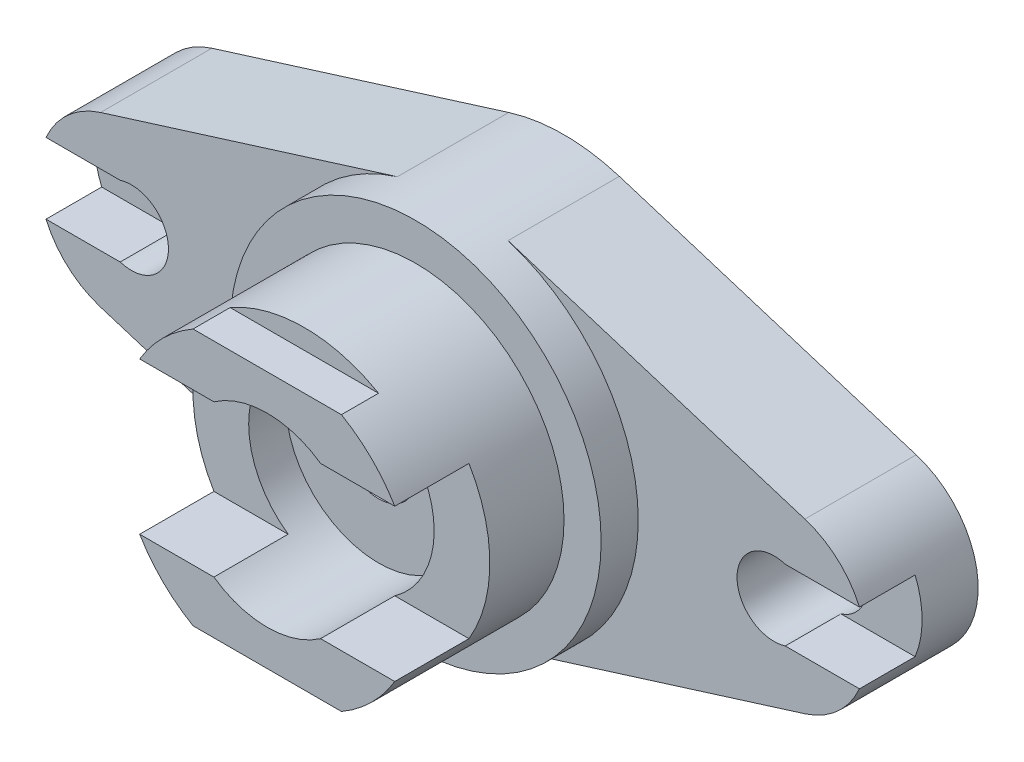
ISO-10303-21;
HEADER;
FILE_DESCRIPTION(('STEP AP214'),'2;1');
FILE_NAME('part.step','',(''),(''),'','','');
FILE_SCHEMA(('AUTOMOTIVE_DESIGN { 1 0 10303 214 1 1 1 1 }'));
ENDSEC;
DATA;
#1=APPLICATION_CONTEXT('core data for automotive mechanical design processes');
#2=APPLICATION_PROTOCOL_DEFINITION('international standard','automotive_design',2000,#1);
#3=PRODUCT_CONTEXT('',#1,'mechanical');
#4=PRODUCT('Part','Part','',(#3));
#5=PRODUCT_RELATED_PRODUCT_CATEGORY('part','',(#4));
#6=PRODUCT_DEFINITION_FORMATION('','',#4);
#7=PRODUCT_DEFINITION_CONTEXT('part definition',#1,'design');
#8=PRODUCT_DEFINITION('design','',#6,#7);
#9=PRODUCT_DEFINITION_SHAPE('','',#8);
#10=(LENGTH_UNIT() NAMED_UNIT(*) SI_UNIT(.MILLI.,.METRE.));
#11=(NAMED_UNIT(*) PLANE_ANGLE_UNIT() SI_UNIT($,.RADIAN.));
#12=(NAMED_UNIT(*) SI_UNIT($,.STERADIAN.) SOLID_ANGLE_UNIT());
#13=UNCERTAINTY_MEASURE_WITH_UNIT(LENGTH_MEASURE(1.E-05),#10,'distance_accuracy_value','');
#14=(GEOMETRIC_REPRESENTATION_CONTEXT(3) GLOBAL_UNCERTAINTY_ASSIGNED_CONTEXT((#13)) GLOBAL_UNIT_ASSIGNED_CONTEXT((#10,
#11,#12)) REPRESENTATION_CONTEXT('',''));
#15=CARTESIAN_POINT('',(0.,0.,0.));
#16=DIRECTION('',(0.,0.,1.));
#17=DIRECTION('',(1.,0.,0.));
#18=AXIS2_PLACEMENT_3D('',#15,#16,#17);
#19=CARTESIAN_POINT('',(0.,0.,0.));
#20=DIRECTION('',(0.,0.,1.));
#21=DIRECTION('',(1.,0.,0.));
#22=AXIS2_PLACEMENT_3D('',#19,#20,#21);
#23=PLANE('',#22);
#24=DIRECTION('',(-1.,0.,0.));
#25=VECTOR('',#24,1.);
#26=CARTESIAN_POINT('',(-54.8131829149659,4.76872966125945,0.));
#27=LINE('',#26,#25);
#28=CARTESIAN_POINT('',(-44.8131829149659,4.76872966125947,0.));
#29=VERTEX_POINT('',#28);
#30=CARTESIAN_POINT('',(-54.8131829149659,4.76872966125945,0.));
#31=VERTEX_POINT('',#30);
#32=EDGE_CURVE('E44',#29,#31,#27,.T.);
#33=ORIENTED_EDGE('',*,*,#32,.F.);
#34=CARTESIAN_POINT('',(-43.3101135826248,0.,0.));
#35=DIRECTION('',(0.,0.,1.));
#36=DIRECTION('',(1.,0.,0.));
#37=AXIS2_PLACEMENT_3D('',#34,#35,#36);
#38=CIRCLE('',#37,5.);
#39=CARTESIAN_POINT('',(-44.8131829149659,-4.76872966125947,0.));
#40=VERTEX_POINT('',#39);
#41=EDGE_CURVE('E293',#40,#29,#38,.T.);
#42=ORIENTED_EDGE('',*,*,#41,.F.);
#43=DIRECTION('',(1.,0.,0.));
#44=VECTOR('',#43,1.);
#45=CARTESIAN_POINT('',(-54.8131829149659,-4.7687296612595,0.));
#46=LINE('',#45,#44);
#47=CARTESIAN_POINT('',(-54.8131829149659,-4.7687296612595,0.));
#48=VERTEX_POINT('',#47);
#49=EDGE_CURVE('E64',#48,#40,#46,.T.);
#50=ORIENTED_EDGE('',*,*,#49,.F.);
#51=CARTESIAN_POINT('',(-43.90625,0.,0.));
#52=DIRECTION('',(0.,0.,-1.));
#53=DIRECTION('',(-1.,0.,0.));
#54=AXIS2_PLACEMENT_3D('',#51,#52,#53);
#55=CIRCLE('',#54,11.9038635826248);
#56=CARTESIAN_POINT('',(-47.4568748283987,-11.3619994508757,0.));
#57=VERTEX_POINT('',#56);
#58=EDGE_CURVE('E38',#57,#48,#55,.T.);
#59=ORIENTED_EDGE('',*,*,#58,.F.);
#60=DIRECTION('',(-0.95447997803503,0.298274993135947,0.));
#61=VECTOR('',#60,1.);
#62=CARTESIAN_POINT('',(-7.45687482839868,-23.8619994508757,0.));
#63=LINE('',#62,#61);
#64=CARTESIAN_POINT('',(-7.45687482839868,-23.8619994508757,0.));
#65=VERTEX_POINT('',#64);
#66=EDGE_CURVE('E335',#65,#57,#63,.T.);
#67=ORIENTED_EDGE('',*,*,#66,.F.);
#68=CARTESIAN_POINT('',(0.,0.,0.));
#69=DIRECTION('',(0.,0.,1.));
#70=DIRECTION('',(1.,0.,0.));
#71=AXIS2_PLACEMENT_3D('',#68,#69,#70);
#72=CIRCLE('',#71,25.);
#73=CARTESIAN_POINT('',(-7.45687482839867,23.8619994508757,0.));
#74=VERTEX_POINT('',#73);
#75=EDGE_CURVE('E441',#74,#65,#72,.T.);
#76=ORIENTED_EDGE('',*,*,#75,.F.);
#77=DIRECTION('',(0.95447997803503,0.298274993135947,0.));
#78=VECTOR('',#77,1.);
#79=CARTESIAN_POINT('',(-7.45687482839867,23.8619994508757,0.));
#80=LINE('',#79,#78);
#81=CARTESIAN_POINT('',(-47.4568748283987,11.3619994508757,0.));
#82=VERTEX_POINT('',#81);
#83=EDGE_CURVE('E327',#82,#74,#80,.T.);
#84=ORIENTED_EDGE('',*,*,#83,.F.);
#85=EDGE_CURVE('E331',#31,#82,#55,.T.);
#86=ORIENTED_EDGE('',*,*,#85,.F.);
#87=EDGE_LOOP('',(#33,#42,#50,#59,#67,#76,#84,#86));
#88=FACE_BOUND('',#87,.T.);
#89=ADVANCED_FACE('F35',(#88),#23,.T.);
#90=DIRECTION('',(-1.,0.,0.));
#91=VECTOR('',#90,1.);
#92=CARTESIAN_POINT('',(44.8131829149659,4.76872966125947,0.));
#93=LINE('',#92,#91);
#94=CARTESIAN_POINT('',(54.8131829149659,4.76872966125947,0.));
#95=VERTEX_POINT('',#94);
#96=CARTESIAN_POINT('',(44.8131829149659,4.76872966125947,0.));
#97=VERTEX_POINT('',#96);
#98=EDGE_CURVE('E561',#95,#97,#93,.T.);
#99=ORIENTED_EDGE('',*,*,#98,.F.);
#100=CARTESIAN_POINT('',(43.90625,0.,0.));
#101=DIRECTION('',(0.,0.,-1.));
#102=DIRECTION('',(-1.,0.,0.));
#103=AXIS2_PLACEMENT_3D('',#100,#101,#102);
#104=CIRCLE('',#103,11.9038635826248);
#105=CARTESIAN_POINT('',(47.4568748283987,11.3619994508757,0.));
#106=VERTEX_POINT('',#105);
#107=EDGE_CURVE('E340',#106,#95,#104,.T.);
#108=ORIENTED_EDGE('',*,*,#107,.F.);
#109=DIRECTION('',(0.95447997803503,-0.298274993135947,0.));
#110=VECTOR('',#109,1.);
#111=CARTESIAN_POINT('',(7.45687482839867,23.8619994508757,0.));
#112=LINE('',#111,#110);
#113=CARTESIAN_POINT('',(7.45687482839867,23.8619994508757,0.));
#114=VERTEX_POINT('',#113);
#115=EDGE_CURVE('E323',#114,#106,#112,.T.);
#116=ORIENTED_EDGE('',*,*,#115,.F.);
#117=CARTESIAN_POINT('',(7.45687482839868,-23.8619994508757,0.));
#118=VERTEX_POINT('',#117);
#119=EDGE_CURVE('E438',#118,#114,#72,.T.);
#120=ORIENTED_EDGE('',*,*,#119,.F.);
#121=DIRECTION('',(-0.95447997803503,-0.298274993135947,0.));
#122=VECTOR('',#121,1.);
#123=CARTESIAN_POINT('',(47.4568748283987,-11.3619994508757,0.));
#124=LINE('',#123,#122);
#125=CARTESIAN_POINT('',(47.4568748283987,-11.3619994508757,0.));
#126=VERTEX_POINT('',#125);
#127=EDGE_CURVE('E336',#126,#118,#124,.T.);
#128=ORIENTED_EDGE('',*,*,#127,.F.);
#129=CARTESIAN_POINT('',(54.8131829149659,-4.76872966125947,0.));
#130=VERTEX_POINT('',#129);
#131=EDGE_CURVE('E244',#130,#126,#104,.T.);
#132=ORIENTED_EDGE('',*,*,#131,.F.);
#133=DIRECTION('',(1.,0.,0.));
#134=VECTOR('',#133,1.);
#135=CARTESIAN_POINT('',(44.8131829149659,-4.76872966125947,0.));
#136=LINE('',#135,#134);
#137=CARTESIAN_POINT('',(44.8131829149659,-4.76872966125947,0.));
#138=VERTEX_POINT('',#137);
#139=EDGE_CURVE('E241',#138,#130,#136,.T.);
#140=ORIENTED_EDGE('',*,*,#139,.F.);
#141=CARTESIAN_POINT('',(43.3101135826248,0.,0.));
#142=DIRECTION('',(0.,0.,1.));
#143=DIRECTION('',(1.,0.,0.));
#144=AXIS2_PLACEMENT_3D('',#141,#142,#143);
#145=CIRCLE('',#144,5.);
#146=EDGE_CURVE('E297',#97,#138,#145,.T.);
#147=ORIENTED_EDGE('',*,*,#146,.F.);
#148=EDGE_LOOP('',(#99,#108,#116,#120,#128,#132,#140,#147));
#149=FACE_BOUND('',#148,.T.);
#150=ADVANCED_FACE('F496',(#149),#23,.T.);
#151=CARTESIAN_POINT('',(0.,0.,25.));
#152=DIRECTION('',(0.,0.,1.));
#153=DIRECTION('',(1.,0.,0.));
#154=AXIS2_PLACEMENT_3D('',#151,#152,#153);
#155=PLANE('',#154);
#156=DIRECTION('',(-1.,0.,0.));
#157=VECTOR('',#156,1.);
#158=CARTESIAN_POINT('',(7.18749999999999,10.226917607471,25.));
#159=LINE('',#158,#157);
#160=CARTESIAN_POINT('',(17.1875,10.226917607471,25.));
#161=VERTEX_POINT('',#160);
#162=CARTESIAN_POINT('',(7.18749999999999,10.226917607471,25.));
#163=VERTEX_POINT('',#162);
#164=EDGE_CURVE('E357',#161,#163,#159,.T.);
#165=ORIENTED_EDGE('',*,*,#164,.F.);
#166=CARTESIAN_POINT('',(0.,0.,25.));
#167=DIRECTION('',(0.,0.,1.));
#168=DIRECTION('',(1.,0.,0.));
#169=AXIS2_PLACEMENT_3D('',#166,#167,#168);
#170=CIRCLE('',#169,20.);
#171=CARTESIAN_POINT('',(10.,17.3205080756888,25.));
#172=VERTEX_POINT('',#171);
#173=EDGE_CURVE('E432',#161,#172,#170,.T.);
#174=ORIENTED_EDGE('',*,*,#173,.T.);
#175=DIRECTION('',(1.,0.,0.));
#176=VECTOR('',#175,1.);
#177=CARTESIAN_POINT('',(-10.,17.3205080756888,25.));
#178=LINE('',#177,#176);
#179=CARTESIAN_POINT('',(-10.,17.3205080756888,25.));
#180=VERTEX_POINT('',#179);
#181=EDGE_CURVE('E420',#180,#172,#178,.T.);
#182=ORIENTED_EDGE('',*,*,#181,.F.);
#183=CARTESIAN_POINT('',(-17.1875,10.226917607471,25.));
#184=VERTEX_POINT('',#183);
#185=EDGE_CURVE('E428',#180,#184,#170,.T.);
#186=ORIENTED_EDGE('',*,*,#185,.T.);
#187=DIRECTION('',(-1.,0.,0.));
#188=VECTOR('',#187,1.);
#189=CARTESIAN_POINT('',(-17.1875,10.226917607471,25.));
#190=LINE('',#189,#188);
#191=CARTESIAN_POINT('',(-7.1875,10.226917607471,25.));
#192=VERTEX_POINT('',#191);
#193=EDGE_CURVE('E385',#192,#184,#190,.T.);
#194=ORIENTED_EDGE('',*,*,#193,.F.);
#195=CARTESIAN_POINT('',(0.,0.,25.));
#196=DIRECTION('',(0.,0.,1.));
#197=DIRECTION('',(1.,0.,0.));
#198=AXIS2_PLACEMENT_3D('',#195,#196,#197);
#199=CIRCLE('',#198,12.5);
#200=EDGE_CURVE('E363',#163,#192,#199,.T.);
#201=ORIENTED_EDGE('',*,*,#200,.F.);
#202=EDGE_LOOP('',(#165,#174,#182,#186,#194,#201));
#203=FACE_BOUND('',#202,.T.);
#204=ADVANCED_FACE('F501',(#203),#155,.T.);
#205=CARTESIAN_POINT('',(0.,0.,5.));
#206=DIRECTION('',(0.,0.,1.));
#207=DIRECTION('',(1.,0.,0.));
#208=AXIS2_PLACEMENT_3D('',#205,#206,#207);
#209=PLANE('',#208);
#210=CARTESIAN_POINT('',(0.,0.,5.));
#211=DIRECTION('',(0.,0.,1.));
#212=DIRECTION('',(1.,0.,0.));
#213=AXIS2_PLACEMENT_3D('',#210,#211,#212);
#214=CIRCLE('',#213,25.);
#215=CARTESIAN_POINT('',(25.,0.,5.));
#216=VERTEX_POINT('',#215);
#217=EDGE_CURVE('E431',#216,#216,#214,.T.);
#218=ORIENTED_EDGE('',*,*,#217,.T.);
#219=EDGE_LOOP('',(#218));
#220=FACE_BOUND('',#219,.T.);
#221=CARTESIAN_POINT('',(0.,0.,5.));
#222=DIRECTION('',(0.,0.,1.));
#223=DIRECTION('',(1.,0.,0.));
#224=AXIS2_PLACEMENT_3D('',#221,#222,#223);
#225=CIRCLE('',#224,20.);
#226=CARTESIAN_POINT('',(20.,0.,5.));
#227=VERTEX_POINT('',#226);
#228=EDGE_CURVE('E426',#227,#227,#225,.T.);
#229=ORIENTED_EDGE('',*,*,#228,.F.);
#230=EDGE_LOOP('',(#229));
#231=FACE_BOUND('',#230,.T.);
#232=ADVANCED_FACE('F610',(#220,#231),#209,.T.);
#233=CARTESIAN_POINT('',(0.,0.,5.));
#234=DIRECTION('',(0.,0.,-1.));
#235=DIRECTION('',(-1.,0.,0.));
#236=AXIS2_PLACEMENT_3D('',#233,#234,#235);
#237=CYLINDRICAL_SURFACE('',#236,25.);
#238=ORIENTED_EDGE('',*,*,#217,.F.);
#239=EDGE_LOOP('',(#238));
#240=FACE_BOUND('',#239,.T.);
#241=ORIENTED_EDGE('',*,*,#119,.T.);
#242=DIRECTION('',(0.,0.,1.));
#243=VECTOR('',#242,1.);
#244=CARTESIAN_POINT('',(7.45687482839867,23.8619994508757,-15.));
#245=LINE('',#244,#243);
#246=CARTESIAN_POINT('',(7.45687482839867,23.8619994508757,-15.));
#247=VERTEX_POINT('',#246);
#248=EDGE_CURVE('E245',#247,#114,#245,.T.);
#249=ORIENTED_EDGE('',*,*,#248,.F.);
#250=CARTESIAN_POINT('',(0.,0.,-15.));
#251=DIRECTION('',(0.,0.,-1.));
#252=DIRECTION('',(1.,0.,0.));
#253=AXIS2_PLACEMENT_3D('',#250,#251,#252);
#254=CIRCLE('',#253,25.);
#255=CARTESIAN_POINT('',(-7.45687482839867,23.8619994508757,-15.));
#256=VERTEX_POINT('',#255);
#257=EDGE_CURVE('E305',#256,#247,#254,.T.);
#258=ORIENTED_EDGE('',*,*,#257,.F.);
#259=DIRECTION('',(0.,0.,1.));
#260=VECTOR('',#259,1.);
#261=CARTESIAN_POINT('',(-7.45687482839867,23.8619994508757,-15.));
#262=LINE('',#261,#260);
#263=EDGE_CURVE('E446',#256,#74,#262,.T.);
#264=ORIENTED_EDGE('',*,*,#263,.T.);
#265=ORIENTED_EDGE('',*,*,#75,.T.);
#266=DIRECTION('',(0.,0.,1.));
#267=VECTOR('',#266,1.);
#268=CARTESIAN_POINT('',(-7.45687482839868,-23.8619994508757,-15.));
#269=LINE('',#268,#267);
#270=CARTESIAN_POINT('',(-7.45687482839868,-23.8619994508757,-15.));
#271=VERTEX_POINT('',#270);
#272=EDGE_CURVE('E461',#271,#65,#269,.T.);
#273=ORIENTED_EDGE('',*,*,#272,.F.);
#274=CARTESIAN_POINT('',(0.,0.,-15.));
#275=DIRECTION('',(0.,0.,-1.));
#276=DIRECTION('',(-1.,0.,0.));
#277=AXIS2_PLACEMENT_3D('',#274,#275,#276);
#278=CIRCLE('',#277,25.);
#279=CARTESIAN_POINT('',(7.45687482839868,-23.8619994508757,-15.));
#280=VERTEX_POINT('',#279);
#281=EDGE_CURVE('E315',#280,#271,#278,.T.);
#282=ORIENTED_EDGE('',*,*,#281,.F.);
#283=DIRECTION('',(0.,0.,1.));
#284=VECTOR('',#283,1.);
#285=CARTESIAN_POINT('',(7.45687482839868,-23.8619994508757,-15.));
#286=LINE('',#285,#284);
#287=EDGE_CURVE('E370',#280,#118,#286,.T.);
#288=ORIENTED_EDGE('',*,*,#287,.T.);
#289=EDGE_LOOP('',(#241,#249,#258,#264,#265,#273,#282,#288));
#290=FACE_BOUND('',#289,.T.);
#291=ADVANCED_FACE('F579',(#240,#290),#237,.T.);
#292=CARTESIAN_POINT('',(0.,0.,25.));
#293=DIRECTION('',(0.,0.,-1.));
#294=DIRECTION('',(-1.,0.,0.));
#295=AXIS2_PLACEMENT_3D('',#292,#293,#294);
#296=CYLINDRICAL_SURFACE('',#295,20.);
#297=ORIENTED_EDGE('',*,*,#173,.F.);
#298=DIRECTION('',(0.,0.,1.));
#299=VECTOR('',#298,1.);
#300=CARTESIAN_POINT('',(17.1875,10.226917607471,15.));
#301=LINE('',#300,#299);
#302=CARTESIAN_POINT('',(17.1875,10.226917607471,15.));
#303=VERTEX_POINT('',#302);
#304=EDGE_CURVE('E356',#303,#161,#301,.T.);
#305=ORIENTED_EDGE('',*,*,#304,.F.);
#306=CARTESIAN_POINT('',(0.,0.,15.));
#307=DIRECTION('',(0.,0.,1.));
#308=DIRECTION('',(1.,0.,0.));
#309=AXIS2_PLACEMENT_3D('',#306,#307,#308);
#310=CIRCLE('',#309,20.);
#311=CARTESIAN_POINT('',(17.1875,-10.226917607471,15.));
#312=VERTEX_POINT('',#311);
#313=EDGE_CURVE('E351',#312,#303,#310,.T.);
#314=ORIENTED_EDGE('',*,*,#313,.F.);
#315=DIRECTION('',(0.,0.,1.));
#316=VECTOR('',#315,1.);
#317=CARTESIAN_POINT('',(17.1875,-10.226917607471,15.));
#318=LINE('',#317,#316);
#319=CARTESIAN_POINT('',(17.1875,-10.226917607471,25.));
#320=VERTEX_POINT('',#319);
#321=EDGE_CURVE('E366',#312,#320,#318,.T.);
#322=ORIENTED_EDGE('',*,*,#321,.T.);
#323=CARTESIAN_POINT('',(10.,-17.3205080756888,25.));
#324=VERTEX_POINT('',#323);
#325=EDGE_CURVE('E423',#324,#320,#170,.T.);
#326=ORIENTED_EDGE('',*,*,#325,.F.);
#327=DIRECTION('',(0.,0.,1.));
#328=VECTOR('',#327,1.);
#329=CARTESIAN_POINT('',(10.,-17.3205080756888,20.));
#330=LINE('',#329,#328);
#331=CARTESIAN_POINT('',(10.,-17.3205080756888,20.));
#332=VERTEX_POINT('',#331);
#333=EDGE_CURVE('E405',#332,#324,#330,.T.);
#334=ORIENTED_EDGE('',*,*,#333,.F.);
#335=CARTESIAN_POINT('',(0.,2.08166817117217E-13,20.));
#336=DIRECTION('',(0.,0.,1.));
#337=DIRECTION('',(1.,0.,0.));
#338=AXIS2_PLACEMENT_3D('',#335,#336,#337);
#339=CIRCLE('',#338,20.0000000000002);
#340=CARTESIAN_POINT('',(-10.,-17.3205080756888,20.));
#341=VERTEX_POINT('',#340);
#342=EDGE_CURVE('E403',#341,#332,#339,.T.);
#343=ORIENTED_EDGE('',*,*,#342,.F.);
#344=DIRECTION('',(0.,0.,1.));
#345=VECTOR('',#344,1.);
#346=CARTESIAN_POINT('',(-10.,-17.3205080756888,20.));
#347=LINE('',#346,#345);
#348=CARTESIAN_POINT('',(-10.,-17.3205080756888,25.));
#349=VERTEX_POINT('',#348);
#350=EDGE_CURVE('E369',#341,#349,#347,.T.);
#351=ORIENTED_EDGE('',*,*,#350,.T.);
#352=CARTESIAN_POINT('',(-17.1875,-10.226917607471,25.));
#353=VERTEX_POINT('',#352);
#354=EDGE_CURVE('E435',#353,#349,#170,.T.);
#355=ORIENTED_EDGE('',*,*,#354,.F.);
#356=DIRECTION('',(0.,0.,1.));
#357=VECTOR('',#356,1.);
#358=CARTESIAN_POINT('',(-17.1875,-10.226917607471,15.));
#359=LINE('',#358,#357);
#360=CARTESIAN_POINT('',(-17.1875,-10.226917607471,15.));
#361=VERTEX_POINT('',#360);
#362=EDGE_CURVE('E376',#361,#353,#359,.T.);
#363=ORIENTED_EDGE('',*,*,#362,.F.);
#364=CARTESIAN_POINT('',(1.14491749414469E-13,0.,15.));
#365=DIRECTION('',(0.,0.,1.));
#366=DIRECTION('',(1.,0.,0.));
#367=AXIS2_PLACEMENT_3D('',#364,#365,#366);
#368=CIRCLE('',#367,20.0000000000001);
#369=CARTESIAN_POINT('',(-17.1875,10.226917607471,15.));
#370=VERTEX_POINT('',#369);
#371=EDGE_CURVE('E372',#370,#361,#368,.T.);
#372=ORIENTED_EDGE('',*,*,#371,.F.);
#373=DIRECTION('',(0.,0.,1.));
#374=VECTOR('',#373,1.);
#375=CARTESIAN_POINT('',(-17.1875,10.226917607471,15.));
#376=LINE('',#375,#374);
#377=EDGE_CURVE('E388',#370,#184,#376,.T.);
#378=ORIENTED_EDGE('',*,*,#377,.T.);
#379=ORIENTED_EDGE('',*,*,#185,.F.);
#380=DIRECTION('',(0.,0.,1.));
#381=VECTOR('',#380,1.);
#382=CARTESIAN_POINT('',(-10.,17.3205080756888,20.));
#383=LINE('',#382,#381);
#384=CARTESIAN_POINT('',(-10.,17.3205080756888,20.));
#385=VERTEX_POINT('',#384);
#386=EDGE_CURVE('E417',#385,#180,#383,.T.);
#387=ORIENTED_EDGE('',*,*,#386,.F.);
#388=CARTESIAN_POINT('',(0.,0.,20.));
#389=DIRECTION('',(0.,0.,1.));
#390=DIRECTION('',(-1.,0.,0.));
#391=AXIS2_PLACEMENT_3D('',#388,#389,#390);
#392=CIRCLE('',#391,20.);
#393=CARTESIAN_POINT('',(10.,17.3205080756888,20.));
#394=VERTEX_POINT('',#393);
#395=EDGE_CURVE('E415',#394,#385,#392,.T.);
#396=ORIENTED_EDGE('',*,*,#395,.F.);
#397=DIRECTION('',(0.,0.,1.));
#398=VECTOR('',#397,1.);
#399=CARTESIAN_POINT('',(10.,17.3205080756888,20.));
#400=LINE('',#399,#398);
#401=EDGE_CURVE('E391',#394,#172,#400,.T.);
#402=ORIENTED_EDGE('',*,*,#401,.T.);
#403=EDGE_LOOP('',(#297,#305,#314,#322,#326,#334,#343,#351,#355,#363,#372,#378,#379,#387,#396,#402));
#404=FACE_BOUND('',#403,.T.);
#405=ORIENTED_EDGE('',*,*,#228,.T.);
#406=EDGE_LOOP('',(#405));
#407=FACE_BOUND('',#406,.T.);
#408=ADVANCED_FACE('F609',(#404,#407),#296,.T.);
#409=DIRECTION('',(1.,0.,0.));
#410=VECTOR('',#409,1.);
#411=CARTESIAN_POINT('',(7.1875,-10.226917607471,25.));
#412=LINE('',#411,#410);
#413=CARTESIAN_POINT('',(7.1875,-10.226917607471,25.));
#414=VERTEX_POINT('',#413);
#415=EDGE_CURVE('E354',#414,#320,#412,.T.);
#416=ORIENTED_EDGE('',*,*,#415,.F.);
#417=CARTESIAN_POINT('',(-7.1875,-10.226917607471,25.));
#418=VERTEX_POINT('',#417);
#419=EDGE_CURVE('E397',#418,#414,#199,.T.);
#420=ORIENTED_EDGE('',*,*,#419,.F.);
#421=DIRECTION('',(1.,0.,0.));
#422=VECTOR('',#421,1.);
#423=CARTESIAN_POINT('',(-17.1875,-10.226917607471,25.));
#424=LINE('',#423,#422);
#425=EDGE_CURVE('E382',#353,#418,#424,.T.);
#426=ORIENTED_EDGE('',*,*,#425,.F.);
#427=ORIENTED_EDGE('',*,*,#354,.T.);
#428=DIRECTION('',(-1.,0.,0.));
#429=VECTOR('',#428,1.);
#430=CARTESIAN_POINT('',(-10.,-17.3205080756888,25.));
#431=LINE('',#430,#429);
#432=EDGE_CURVE('E408',#324,#349,#431,.T.);
#433=ORIENTED_EDGE('',*,*,#432,.F.);
#434=ORIENTED_EDGE('',*,*,#325,.T.);
#435=EDGE_LOOP('',(#416,#420,#426,#427,#433,#434));
#436=FACE_BOUND('',#435,.T.);
#437=ADVANCED_FACE('F617',(#436),#155,.T.);
#438=CARTESIAN_POINT('',(-10.,17.3205080756888,20.));
#439=DIRECTION('',(0.,-1.,0.));
#440=DIRECTION('',(0.,0.,-1.));
#441=AXIS2_PLACEMENT_3D('',#438,#439,#440);
#442=PLANE('',#441);
#443=ORIENTED_EDGE('',*,*,#181,.T.);
#444=ORIENTED_EDGE('',*,*,#401,.F.);
#445=DIRECTION('',(1.,0.,0.));
#446=VECTOR('',#445,1.);
#447=CARTESIAN_POINT('',(-10.,17.3205080756888,20.));
#448=LINE('',#447,#446);
#449=EDGE_CURVE('E411',#385,#394,#448,.T.);
#450=ORIENTED_EDGE('',*,*,#449,.F.);
#451=ORIENTED_EDGE('',*,*,#386,.T.);
#452=EDGE_LOOP('',(#443,#444,#450,#451));
#453=FACE_BOUND('',#452,.T.);
#454=ADVANCED_FACE('F621',(#453),#442,.F.);
#455=CARTESIAN_POINT('',(0.,0.,20.));
#456=DIRECTION('',(0.,0.,-1.));
#457=DIRECTION('',(-1.,0.,0.));
#458=AXIS2_PLACEMENT_3D('',#455,#456,#457);
#459=PLANE('',#458);
#460=ORIENTED_EDGE('',*,*,#395,.T.);
#461=ORIENTED_EDGE('',*,*,#449,.T.);
#462=EDGE_LOOP('',(#460,#461));
#463=FACE_BOUND('',#462,.T.);
#464=ADVANCED_FACE('F625',(#463),#459,.F.);
#465=CARTESIAN_POINT('',(-10.,-17.3205080756888,20.));
#466=DIRECTION('',(0.,1.,0.));
#467=DIRECTION('',(0.,0.,1.));
#468=AXIS2_PLACEMENT_3D('',#465,#466,#467);
#469=PLANE('',#468);
#470=ORIENTED_EDGE('',*,*,#432,.T.);
#471=ORIENTED_EDGE('',*,*,#350,.F.);
#472=DIRECTION('',(-1.,0.,0.));
#473=VECTOR('',#472,1.);
#474=CARTESIAN_POINT('',(-10.,-17.3205080756888,20.));
#475=LINE('',#474,#473);
#476=EDGE_CURVE('E364',#332,#341,#475,.T.);
#477=ORIENTED_EDGE('',*,*,#476,.F.);
#478=ORIENTED_EDGE('',*,*,#333,.T.);
#479=EDGE_LOOP('',(#470,#471,#477,#478));
#480=FACE_BOUND('',#479,.T.);
#481=ADVANCED_FACE('F629',(#480),#469,.F.);
#482=CARTESIAN_POINT('',(0.,2.08166817117217E-13,20.));
#483=DIRECTION('',(0.,0.,1.));
#484=DIRECTION('',(1.,0.,0.));
#485=AXIS2_PLACEMENT_3D('',#482,#483,#484);
#486=PLANE('',#485);
#487=ORIENTED_EDGE('',*,*,#342,.T.);
#488=ORIENTED_EDGE('',*,*,#476,.T.);
#489=EDGE_LOOP('',(#487,#488));
#490=FACE_BOUND('',#489,.T.);
#491=ADVANCED_FACE('F633',(#490),#486,.T.);
#492=CARTESIAN_POINT('',(0.,0.,10.));
#493=DIRECTION('',(0.,0.,1.));
#494=DIRECTION('',(1.,0.,0.));
#495=AXIS2_PLACEMENT_3D('',#492,#493,#494);
#496=CYLINDRICAL_SURFACE('',#495,12.5);
#497=CARTESIAN_POINT('',(0.,0.,15.));
#498=DIRECTION('',(0.,0.,-1.));
#499=DIRECTION('',(1.,0.,0.));
#500=AXIS2_PLACEMENT_3D('',#497,#498,#499);
#501=CIRCLE('',#500,12.5);
#502=CARTESIAN_POINT('',(7.18749999999999,10.226917607471,15.));
#503=VERTEX_POINT('',#502);
#504=CARTESIAN_POINT('',(7.1875,-10.226917607471,15.));
#505=VERTEX_POINT('',#504);
#506=EDGE_CURVE('E344',#503,#505,#501,.T.);
#507=ORIENTED_EDGE('',*,*,#506,.F.);
#508=DIRECTION('',(0.,0.,1.));
#509=VECTOR('',#508,1.);
#510=CARTESIAN_POINT('',(7.18749999999999,10.226917607471,15.));
#511=LINE('',#510,#509);
#512=EDGE_CURVE('E360',#503,#163,#511,.T.);
#513=ORIENTED_EDGE('',*,*,#512,.T.);
#514=ORIENTED_EDGE('',*,*,#200,.T.);
#515=DIRECTION('',(0.,0.,1.));
#516=VECTOR('',#515,1.);
#517=CARTESIAN_POINT('',(-7.1875,10.226917607471,15.));
#518=LINE('',#517,#516);
#519=CARTESIAN_POINT('',(-7.1875,10.226917607471,15.));
#520=VERTEX_POINT('',#519);
#521=EDGE_CURVE('E384',#520,#192,#518,.T.);
#522=ORIENTED_EDGE('',*,*,#521,.F.);
#523=CARTESIAN_POINT('',(0.,0.,15.));
#524=DIRECTION('',(0.,0.,-1.));
#525=DIRECTION('',(-1.,0.,0.));
#526=AXIS2_PLACEMENT_3D('',#523,#524,#525);
#527=CIRCLE('',#526,12.5);
#528=CARTESIAN_POINT('',(-7.1875,-10.226917607471,15.));
#529=VERTEX_POINT('',#528);
#530=EDGE_CURVE('E378',#529,#520,#527,.T.);
#531=ORIENTED_EDGE('',*,*,#530,.F.);
#532=DIRECTION('',(0.,0.,1.));
#533=VECTOR('',#532,1.);
#534=CARTESIAN_POINT('',(-7.1875,-10.226917607471,15.));
#535=LINE('',#534,#533);
#536=EDGE_CURVE('E394',#529,#418,#535,.T.);
#537=ORIENTED_EDGE('',*,*,#536,.T.);
#538=ORIENTED_EDGE('',*,*,#419,.T.);
#539=DIRECTION('',(0.,0.,1.));
#540=VECTOR('',#539,1.);
#541=CARTESIAN_POINT('',(7.1875,-10.226917607471,15.));
#542=LINE('',#541,#540);
#543=EDGE_CURVE('E348',#505,#414,#542,.T.);
#544=ORIENTED_EDGE('',*,*,#543,.F.);
#545=EDGE_LOOP('',(#507,#513,#514,#522,#531,#537,#538,#544));
#546=FACE_BOUND('',#545,.T.);
#547=CARTESIAN_POINT('',(0.,0.,10.));
#548=DIRECTION('',(0.,0.,1.));
#549=DIRECTION('',(1.,0.,0.));
#550=AXIS2_PLACEMENT_3D('',#547,#548,#549);
#551=CIRCLE('',#550,12.5);
#552=CARTESIAN_POINT('',(12.5,0.,10.));
#553=VERTEX_POINT('',#552);
#554=EDGE_CURVE('E387',#553,#553,#551,.T.);
#555=ORIENTED_EDGE('',*,*,#554,.F.);
#556=EDGE_LOOP('',(#555));
#557=FACE_BOUND('',#556,.T.);
#558=ADVANCED_FACE('F637',(#546,#557),#496,.F.);
#559=CARTESIAN_POINT('',(0.,0.,10.));
#560=DIRECTION('',(0.,0.,1.));
#561=DIRECTION('',(1.,0.,0.));
#562=AXIS2_PLACEMENT_3D('',#559,#560,#561);
#563=PLANE('',#562);
#564=CARTESIAN_POINT('',(0.,0.,10.));
#565=DIRECTION('',(0.,0.,1.));
#566=DIRECTION('',(1.,0.,0.));
#567=AXIS2_PLACEMENT_3D('',#564,#565,#566);
#568=CIRCLE('',#567,5.);
#569=CARTESIAN_POINT('',(5.,0.,10.));
#570=VERTEX_POINT('',#569);
#571=EDGE_CURVE('E304',#570,#570,#568,.T.);
#572=ORIENTED_EDGE('',*,*,#571,.F.);
#573=EDGE_LOOP('',(#572));
#574=FACE_BOUND('',#573,.T.);
#575=ORIENTED_EDGE('',*,*,#554,.T.);
#576=EDGE_LOOP('',(#575));
#577=FACE_BOUND('',#576,.T.);
#578=ADVANCED_FACE('F641',(#574,#577),#563,.T.);
#579=CARTESIAN_POINT('',(-17.1875,10.226917607471,15.));
#580=DIRECTION('',(0.,1.,0.));
#581=DIRECTION('',(-1.,0.,0.));
#582=AXIS2_PLACEMENT_3D('',#579,#580,#581);
#583=PLANE('',#582);
#584=ORIENTED_EDGE('',*,*,#193,.T.);
#585=ORIENTED_EDGE('',*,*,#377,.F.);
#586=DIRECTION('',(-1.,0.,0.));
#587=VECTOR('',#586,1.);
#588=CARTESIAN_POINT('',(-17.1875,10.226917607471,15.));
#589=LINE('',#588,#587);
#590=EDGE_CURVE('E359',#520,#370,#589,.T.);
#591=ORIENTED_EDGE('',*,*,#590,.F.);
#592=ORIENTED_EDGE('',*,*,#521,.T.);
#593=EDGE_LOOP('',(#584,#585,#591,#592));
#594=FACE_BOUND('',#593,.T.);
#595=ADVANCED_FACE('F645',(#594),#583,.F.);
#596=CARTESIAN_POINT('',(-17.1875,-10.226917607471,15.));
#597=DIRECTION('',(0.,-1.,0.));
#598=DIRECTION('',(0.,0.,-1.));
#599=AXIS2_PLACEMENT_3D('',#596,#597,#598);
#600=PLANE('',#599);
#601=ORIENTED_EDGE('',*,*,#425,.T.);
#602=ORIENTED_EDGE('',*,*,#536,.F.);
#603=DIRECTION('',(1.,0.,0.));
#604=VECTOR('',#603,1.);
#605=CARTESIAN_POINT('',(-17.1875,-10.226917607471,15.));
#606=LINE('',#605,#604);
#607=EDGE_CURVE('E375',#361,#529,#606,.T.);
#608=ORIENTED_EDGE('',*,*,#607,.F.);
#609=ORIENTED_EDGE('',*,*,#362,.T.);
#610=EDGE_LOOP('',(#601,#602,#608,#609));
#611=FACE_BOUND('',#610,.T.);
#612=ADVANCED_FACE('F647',(#611),#600,.F.);
#613=CARTESIAN_POINT('',(1.14491749414469E-13,0.,15.));
#614=DIRECTION('',(0.,0.,1.));
#615=DIRECTION('',(1.,0.,0.));
#616=AXIS2_PLACEMENT_3D('',#613,#614,#615);
#617=PLANE('',#616);
#618=ORIENTED_EDGE('',*,*,#371,.T.);
#619=ORIENTED_EDGE('',*,*,#607,.T.);
#620=ORIENTED_EDGE('',*,*,#530,.T.);
#621=ORIENTED_EDGE('',*,*,#590,.T.);
#622=EDGE_LOOP('',(#618,#619,#620,#621));
#623=FACE_BOUND('',#622,.T.);
#624=ADVANCED_FACE('F650',(#623),#617,.T.);
#625=CARTESIAN_POINT('',(7.18749999999999,10.226917607471,15.));
#626=DIRECTION('',(0.,1.,0.));
#627=DIRECTION('',(0.,0.,1.));
#628=AXIS2_PLACEMENT_3D('',#625,#626,#627);
#629=PLANE('',#628);
#630=ORIENTED_EDGE('',*,*,#164,.T.);
#631=ORIENTED_EDGE('',*,*,#512,.F.);
#632=DIRECTION('',(-1.,0.,0.));
#633=VECTOR('',#632,1.);
#634=CARTESIAN_POINT('',(7.18749999999999,10.226917607471,15.));
#635=LINE('',#634,#633);
#636=EDGE_CURVE('E343',#303,#503,#635,.T.);
#637=ORIENTED_EDGE('',*,*,#636,.F.);
#638=ORIENTED_EDGE('',*,*,#304,.T.);
#639=EDGE_LOOP('',(#630,#631,#637,#638));
#640=FACE_BOUND('',#639,.T.);
#641=ADVANCED_FACE('F657',(#640),#629,.F.);
#642=CARTESIAN_POINT('',(7.1875,-10.226917607471,15.));
#643=DIRECTION('',(0.,-1.,0.));
#644=DIRECTION('',(1.,0.,0.));
#645=AXIS2_PLACEMENT_3D('',#642,#643,#644);
#646=PLANE('',#645);
#647=ORIENTED_EDGE('',*,*,#415,.T.);
#648=ORIENTED_EDGE('',*,*,#321,.F.);
#649=DIRECTION('',(1.,0.,0.));
#650=VECTOR('',#649,1.);
#651=CARTESIAN_POINT('',(7.1875,-10.226917607471,15.));
#652=LINE('',#651,#650);
#653=EDGE_CURVE('E347',#505,#312,#652,.T.);
#654=ORIENTED_EDGE('',*,*,#653,.F.);
#655=ORIENTED_EDGE('',*,*,#543,.T.);
#656=EDGE_LOOP('',(#647,#648,#654,#655));
#657=FACE_BOUND('',#656,.T.);
#658=ADVANCED_FACE('F659',(#657),#646,.F.);
#659=CARTESIAN_POINT('',(0.,0.,15.));
#660=DIRECTION('',(0.,0.,1.));
#661=DIRECTION('',(1.,0.,0.));
#662=AXIS2_PLACEMENT_3D('',#659,#660,#661);
#663=PLANE('',#662);
#664=ORIENTED_EDGE('',*,*,#506,.T.);
#665=ORIENTED_EDGE('',*,*,#653,.T.);
#666=ORIENTED_EDGE('',*,*,#313,.T.);
#667=ORIENTED_EDGE('',*,*,#636,.T.);
#668=EDGE_LOOP('',(#664,#665,#666,#667));
#669=FACE_BOUND('',#668,.T.);
#670=ADVANCED_FACE('F662',(#669),#663,.T.);
#671=CARTESIAN_POINT('',(0.,0.,-146.));
#672=DIRECTION('',(0.,0.,1.));
#673=DIRECTION('',(1.,0.,0.));
#674=AXIS2_PLACEMENT_3D('',#671,#672,#673);
#675=CYLINDRICAL_SURFACE('',#674,5.);
#676=ORIENTED_EDGE('',*,*,#571,.T.);
#677=EDGE_LOOP('',(#676));
#678=FACE_BOUND('',#677,.T.);
#679=CARTESIAN_POINT('',(0.,0.,-15.));
#680=DIRECTION('',(0.,0.,-1.));
#681=DIRECTION('',(-1.,0.,0.));
#682=AXIS2_PLACEMENT_3D('',#679,#680,#681);
#683=CIRCLE('',#682,4.99999999999998);
#684=CARTESIAN_POINT('',(-4.99999999999997,0.,-15.));
#685=VERTEX_POINT('',#684);
#686=EDGE_CURVE('E301',#685,#685,#683,.T.);
#687=ORIENTED_EDGE('',*,*,#686,.T.);
#688=EDGE_LOOP('',(#687));
#689=FACE_BOUND('',#688,.T.);
#690=ADVANCED_FACE('F669',(#678,#689),#675,.F.);
#691=CARTESIAN_POINT('',(0.,0.,-15.));
#692=DIRECTION('',(0.,0.,1.));
#693=DIRECTION('',(1.,0.,0.));
#694=AXIS2_PLACEMENT_3D('',#691,#692,#693);
#695=PLANE('',#694);
#696=CARTESIAN_POINT('',(-43.3101135826248,0.,-15.));
#697=DIRECTION('',(0.,0.,1.));
#698=DIRECTION('',(1.,0.,0.));
#699=AXIS2_PLACEMENT_3D('',#696,#697,#698);
#700=CIRCLE('',#699,5.);
#701=CARTESIAN_POINT('',(-38.3101135826248,0.,-15.));
#702=VERTEX_POINT('',#701);
#703=EDGE_CURVE('E254',#702,#702,#700,.T.);
#704=ORIENTED_EDGE('',*,*,#703,.T.);
#705=EDGE_LOOP('',(#704));
#706=FACE_BOUND('',#705,.T.);
#707=CARTESIAN_POINT('',(43.3101135826248,0.,-15.));
#708=DIRECTION('',(0.,0.,1.));
#709=DIRECTION('',(1.,0.,0.));
#710=AXIS2_PLACEMENT_3D('',#707,#708,#709);
#711=CIRCLE('',#710,5.);
#712=CARTESIAN_POINT('',(48.3101135826248,0.,-15.));
#713=VERTEX_POINT('',#712);
#714=EDGE_CURVE('E309',#713,#713,#711,.T.);
#715=ORIENTED_EDGE('',*,*,#714,.T.);
#716=EDGE_LOOP('',(#715));
#717=FACE_BOUND('',#716,.T.);
#718=ORIENTED_EDGE('',*,*,#257,.T.);
#719=DIRECTION('',(0.95447997803503,-0.298274993135947,0.));
#720=VECTOR('',#719,1.);
#721=CARTESIAN_POINT('',(7.45687482839867,23.8619994508757,-15.));
#722=LINE('',#721,#720);
#723=CARTESIAN_POINT('',(47.4568748283987,11.3619994508757,-15.));
#724=VERTEX_POINT('',#723);
#725=EDGE_CURVE('E308',#247,#724,#722,.T.);
#726=ORIENTED_EDGE('',*,*,#725,.T.);
#727=CARTESIAN_POINT('',(43.90625,0.,-15.));
#728=DIRECTION('',(0.,0.,-1.));
#729=DIRECTION('',(-1.,0.,0.));
#730=AXIS2_PLACEMENT_3D('',#727,#728,#729);
#731=CIRCLE('',#730,11.9038635826248);
#732=CARTESIAN_POINT('',(47.4568748283987,-11.3619994508757,-15.));
#733=VERTEX_POINT('',#732);
#734=EDGE_CURVE('E311',#724,#733,#731,.T.);
#735=ORIENTED_EDGE('',*,*,#734,.T.);
#736=DIRECTION('',(-0.95447997803503,-0.298274993135947,0.));
#737=VECTOR('',#736,1.);
#738=CARTESIAN_POINT('',(47.4568748283987,-11.3619994508757,-15.));
#739=LINE('',#738,#737);
#740=EDGE_CURVE('E313',#733,#280,#739,.T.);
#741=ORIENTED_EDGE('',*,*,#740,.T.);
#742=ORIENTED_EDGE('',*,*,#281,.T.);
#743=DIRECTION('',(-0.95447997803503,0.298274993135947,0.));
#744=VECTOR('',#743,1.);
#745=CARTESIAN_POINT('',(-7.45687482839868,-23.8619994508757,-15.));
#746=LINE('',#745,#744);
#747=CARTESIAN_POINT('',(-47.4568748283987,-11.3619994508757,-15.));
#748=VERTEX_POINT('',#747);
#749=EDGE_CURVE('E317',#271,#748,#746,.T.);
#750=ORIENTED_EDGE('',*,*,#749,.T.);
#751=CARTESIAN_POINT('',(-43.90625,0.,-15.));
#752=DIRECTION('',(0.,0.,-1.));
#753=DIRECTION('',(-1.,0.,0.));
#754=AXIS2_PLACEMENT_3D('',#751,#752,#753);
#755=CIRCLE('',#754,11.9038635826248);
#756=CARTESIAN_POINT('',(-47.4568748283987,11.3619994508757,-15.));
#757=VERTEX_POINT('',#756);
#758=EDGE_CURVE('E319',#748,#757,#755,.T.);
#759=ORIENTED_EDGE('',*,*,#758,.T.);
#760=DIRECTION('',(0.95447997803503,0.298274993135947,0.));
#761=VECTOR('',#760,1.);
#762=CARTESIAN_POINT('',(-7.45687482839867,23.8619994508757,-15.));
#763=LINE('',#762,#761);
#764=EDGE_CURVE('E321',#757,#256,#763,.T.);
#765=ORIENTED_EDGE('',*,*,#764,.T.);
#766=EDGE_LOOP('',(#718,#726,#735,#741,#742,#750,#759,#765));
#767=FACE_BOUND('',#766,.T.);
#768=ORIENTED_EDGE('',*,*,#686,.F.);
#769=EDGE_LOOP('',(#768));
#770=FACE_BOUND('',#769,.T.);
#771=ADVANCED_FACE('F483',(#706,#717,#767,#770),#695,.F.);
#772=CARTESIAN_POINT('',(7.45687482839867,23.8619994508757,-15.));
#773=DIRECTION('',(-0.298274993135947,-0.95447997803503,0.));
#774=DIRECTION('',(0.95447997803503,-0.298274993135947,0.));
#775=AXIS2_PLACEMENT_3D('',#772,#773,#774);
#776=PLANE('',#775);
#777=ORIENTED_EDGE('',*,*,#115,.T.);
#778=DIRECTION('',(0.,0.,1.));
#779=VECTOR('',#778,1.);
#780=CARTESIAN_POINT('',(47.4568748283987,11.3619994508757,-15.));
#781=LINE('',#780,#779);
#782=EDGE_CURVE('E337',#724,#106,#781,.T.);
#783=ORIENTED_EDGE('',*,*,#782,.F.);
#784=ORIENTED_EDGE('',*,*,#725,.F.);
#785=ORIENTED_EDGE('',*,*,#248,.T.);
#786=EDGE_LOOP('',(#777,#783,#784,#785));
#787=FACE_BOUND('',#786,.T.);
#788=ADVANCED_FACE('F271',(#787),#776,.F.);
#789=CARTESIAN_POINT('',(43.90625,0.,-15.));
#790=DIRECTION('',(0.,0.,1.));
#791=DIRECTION('',(1.,0.,0.));
#792=AXIS2_PLACEMENT_3D('',#789,#790,#791);
#793=CYLINDRICAL_SURFACE('',#792,11.9038635826248);
#794=CARTESIAN_POINT('',(54.8131829149659,-4.76872966125947,-7.5));
#795=CARTESIAN_POINT('',(55.2814241037928,-3.63418254615043,-7.5));
#796=CARTESIAN_POINT('',(55.5199411205534,-2.43076778240164,-7.5));
#797=CARTESIAN_POINT('',(55.7586180049216,-1.22654642195079,-7.5));
#798=CARTESIAN_POINT('',(55.7585640368798,0.,-7.5));
#799=CARTESIAN_POINT('',(55.7585100204379,1.22764642192842,-7.5));
#800=CARTESIAN_POINT('',(55.5199411205534,2.43076778240163,-7.5));
#801=CARTESIAN_POINT('',(55.2812122576282,3.63469584882557,-7.5));
#802=CARTESIAN_POINT('',(54.8131829149659,4.76872966125947,-7.5));
#803=B_SPLINE_CURVE_WITH_KNOTS('',2,(#794,#795,#796,#797,#798,#799,#800,#801,#802),
.UNSPECIFIED.,.F.,.F.,(3,2,2,2,3),(0.,0.25,0.5,0.75,1.),.UNSPECIFIED.);
#804=CARTESIAN_POINT('',(54.8131829149659,-4.76872966125947,-7.5));
#805=VERTEX_POINT('',#804);
#806=CARTESIAN_POINT('',(54.8131829149659,4.76872966125947,-7.5));
#807=VERTEX_POINT('',#806);
#808=EDGE_CURVE('E229',#805,#807,#803,.T.);
#809=ORIENTED_EDGE('',*,*,#808,.F.);
#810=DIRECTION('',(0.,0.,1.));
#811=VECTOR('',#810,1.);
#812=CARTESIAN_POINT('',(54.8131829149659,-4.76872966125947,-15.));
#813=LINE('',#812,#811);
#814=EDGE_CURVE('E238',#805,#130,#813,.T.);
#815=ORIENTED_EDGE('',*,*,#814,.T.);
#816=ORIENTED_EDGE('',*,*,#131,.T.);
#817=DIRECTION('',(0.,0.,1.));
#818=VECTOR('',#817,1.);
#819=CARTESIAN_POINT('',(47.4568748283987,-11.3619994508757,-15.));
#820=LINE('',#819,#818);
#821=EDGE_CURVE('E332',#733,#126,#820,.T.);
#822=ORIENTED_EDGE('',*,*,#821,.F.);
#823=ORIENTED_EDGE('',*,*,#734,.F.);
#824=ORIENTED_EDGE('',*,*,#782,.T.);
#825=ORIENTED_EDGE('',*,*,#107,.T.);
#826=DIRECTION('',(0.,0.,1.));
#827=VECTOR('',#826,1.);
#828=CARTESIAN_POINT('',(54.8131829149659,4.76872966125946,-3.75));
#829=LINE('',#828,#827);
#830=EDGE_CURVE('E250',#807,#95,#829,.T.);
#831=ORIENTED_EDGE('',*,*,#830,.F.);
#832=EDGE_LOOP('',(#809,#815,#816,#822,#823,#824,#825,#831));
#833=FACE_BOUND('',#832,.T.);
#834=ADVANCED_FACE('F248',(#833),#793,.T.);
#835=CARTESIAN_POINT('',(47.4568748283987,-11.3619994508757,-15.));
#836=DIRECTION('',(-0.298274993135947,0.95447997803503,0.));
#837=DIRECTION('',(-0.95447997803503,-0.298274993135947,0.));
#838=AXIS2_PLACEMENT_3D('',#835,#836,#837);
#839=PLANE('',#838);
#840=ORIENTED_EDGE('',*,*,#127,.T.);
#841=ORIENTED_EDGE('',*,*,#287,.F.);
#842=ORIENTED_EDGE('',*,*,#740,.F.);
#843=ORIENTED_EDGE('',*,*,#821,.T.);
#844=EDGE_LOOP('',(#840,#841,#842,#843));
#845=FACE_BOUND('',#844,.T.);
#846=ADVANCED_FACE('F270',(#845),#839,.F.);
#847=CARTESIAN_POINT('',(-7.45687482839868,-23.8619994508757,-15.));
#848=DIRECTION('',(0.298274993135947,0.95447997803503,0.));
#849=DIRECTION('',(-0.95447997803503,0.298274993135947,0.));
#850=AXIS2_PLACEMENT_3D('',#847,#848,#849);
#851=PLANE('',#850);
#852=ORIENTED_EDGE('',*,*,#66,.T.);
#853=DIRECTION('',(0.,0.,1.));
#854=VECTOR('',#853,1.);
#855=CARTESIAN_POINT('',(-47.4568748283987,-11.3619994508757,-15.));
#856=LINE('',#855,#854);
#857=EDGE_CURVE('E328',#748,#57,#856,.T.);
#858=ORIENTED_EDGE('',*,*,#857,.F.);
#859=ORIENTED_EDGE('',*,*,#749,.F.);
#860=ORIENTED_EDGE('',*,*,#272,.T.);
#861=EDGE_LOOP('',(#852,#858,#859,#860));
#862=FACE_BOUND('',#861,.T.);
#863=ADVANCED_FACE('F541',(#862),#851,.F.);
#864=CARTESIAN_POINT('',(-43.90625,0.,-15.));
#865=DIRECTION('',(0.,0.,1.));
#866=DIRECTION('',(1.,0.,0.));
#867=AXIS2_PLACEMENT_3D('',#864,#865,#866);
#868=CYLINDRICAL_SURFACE('',#867,11.9038635826248);
#869=CARTESIAN_POINT('',(-54.8131829149659,4.76872966125945,-7.5));
#870=CARTESIAN_POINT('',(-55.2814241037928,3.63418254615042,-7.5));
#871=CARTESIAN_POINT('',(-55.5199411205534,2.43076778240161,-7.5));
#872=CARTESIAN_POINT('',(-55.7586180049216,1.2265464219508,-7.5));
#873=CARTESIAN_POINT('',(-55.7585640368797,0.,-7.5));
#874=CARTESIAN_POINT('',(-55.7585100204379,-1.22764642192894,-7.5));
#875=CARTESIAN_POINT('',(-55.5199411205534,-2.43076778240166,-7.5));
#876=CARTESIAN_POINT('',(-55.281212257628,-3.63469584882604,-7.5));
#877=CARTESIAN_POINT('',(-54.8131829149659,-4.76872966125949,-7.5));
#878=B_SPLINE_CURVE_WITH_KNOTS('',2,(#869,#870,#871,#872,#873,#874,#875,#876,#877),
.UNSPECIFIED.,.F.,.F.,(3,2,2,2,3),(0.,0.25,0.5,0.75,1.),.UNSPECIFIED.);
#879=CARTESIAN_POINT('',(-54.8131829149659,4.76872966125945,-7.5));
#880=VERTEX_POINT('',#879);
#881=CARTESIAN_POINT('',(-54.8131829149659,-4.7687296612595,-7.5));
#882=VERTEX_POINT('',#881);
#883=EDGE_CURVE('E517',#880,#882,#878,.T.);
#884=ORIENTED_EDGE('',*,*,#883,.F.);
#885=DIRECTION('',(0.,0.,1.));
#886=VECTOR('',#885,1.);
#887=CARTESIAN_POINT('',(-54.8131829149659,4.76872966125945,-15.));
#888=LINE('',#887,#886);
#889=EDGE_CURVE('E463',#880,#31,#888,.T.);
#890=ORIENTED_EDGE('',*,*,#889,.T.);
#891=ORIENTED_EDGE('',*,*,#85,.T.);
#892=DIRECTION('',(0.,0.,1.));
#893=VECTOR('',#892,1.);
#894=CARTESIAN_POINT('',(-47.4568748283987,11.3619994508757,-15.));
#895=LINE('',#894,#893);
#896=EDGE_CURVE('E324',#757,#82,#895,.T.);
#897=ORIENTED_EDGE('',*,*,#896,.F.);
#898=ORIENTED_EDGE('',*,*,#758,.F.);
#899=ORIENTED_EDGE('',*,*,#857,.T.);
#900=ORIENTED_EDGE('',*,*,#58,.T.);
#901=DIRECTION('',(0.,0.,1.));
#902=VECTOR('',#901,1.);
#903=CARTESIAN_POINT('',(-54.8131829149659,-4.7687296612595,-15.));
#904=LINE('',#903,#902);
#905=EDGE_CURVE('E471',#48,#882,#904,.F.);
#906=ORIENTED_EDGE('',*,*,#905,.T.);
#907=EDGE_LOOP('',(#884,#890,#891,#897,#898,#899,#900,#906));
#908=FACE_BOUND('',#907,.T.);
#909=ADVANCED_FACE('F538',(#908),#868,.T.);
#910=CARTESIAN_POINT('',(-7.45687482839867,23.8619994508757,-15.));
#911=DIRECTION('',(0.298274993135947,-0.95447997803503,0.));
#912=DIRECTION('',(0.95447997803503,0.298274993135947,0.));
#913=AXIS2_PLACEMENT_3D('',#910,#911,#912);
#914=PLANE('',#913);
#915=ORIENTED_EDGE('',*,*,#83,.T.);
#916=ORIENTED_EDGE('',*,*,#263,.F.);
#917=ORIENTED_EDGE('',*,*,#764,.F.);
#918=ORIENTED_EDGE('',*,*,#896,.T.);
#919=EDGE_LOOP('',(#915,#916,#917,#918));
#920=FACE_BOUND('',#919,.T.);
#921=ADVANCED_FACE('F492',(#920),#914,.F.);
#922=CARTESIAN_POINT('',(43.3101135826248,0.,-236.));
#923=DIRECTION('',(0.,0.,1.));
#924=DIRECTION('',(1.,0.,0.));
#925=AXIS2_PLACEMENT_3D('',#922,#923,#924);
#926=CYLINDRICAL_SURFACE('',#925,5.);
#927=CARTESIAN_POINT('',(43.3101135826248,0.,-7.5));
#928=DIRECTION('',(0.,0.,-1.));
#929=DIRECTION('',(1.,0.,0.));
#930=AXIS2_PLACEMENT_3D('',#927,#928,#929);
#931=CIRCLE('',#930,5.);
#932=CARTESIAN_POINT('',(44.8131829149659,4.76872966125947,-7.50000000000001));
#933=VERTEX_POINT('',#932);
#934=CARTESIAN_POINT('',(44.8131829149659,-4.76872966125947,-7.5));
#935=VERTEX_POINT('',#934);
#936=EDGE_CURVE('E233',#933,#935,#931,.T.);
#937=ORIENTED_EDGE('',*,*,#936,.F.);
#938=DIRECTION('',(0.,0.,1.));
#939=VECTOR('',#938,1.);
#940=CARTESIAN_POINT('',(44.8131829149659,4.76872966125947,-7.5));
#941=LINE('',#940,#939);
#942=EDGE_CURVE('E300',#933,#97,#941,.T.);
#943=ORIENTED_EDGE('',*,*,#942,.T.);
#944=ORIENTED_EDGE('',*,*,#146,.T.);
#945=DIRECTION('',(0.,0.,1.));
#946=VECTOR('',#945,1.);
#947=CARTESIAN_POINT('',(44.8131829149659,-4.76872966125947,-7.5));
#948=LINE('',#947,#946);
#949=EDGE_CURVE('E560',#935,#138,#948,.T.);
#950=ORIENTED_EDGE('',*,*,#949,.F.);
#951=EDGE_LOOP('',(#937,#943,#944,#950));
#952=FACE_BOUND('',#951,.T.);
#953=ORIENTED_EDGE('',*,*,#714,.F.);
#954=EDGE_LOOP('',(#953));
#955=FACE_BOUND('',#954,.T.);
#956=ADVANCED_FACE('F486',(#952,#955),#926,.F.);
#957=CARTESIAN_POINT('',(-43.3101135826248,0.,-236.));
#958=DIRECTION('',(0.,0.,1.));
#959=DIRECTION('',(1.,0.,0.));
#960=AXIS2_PLACEMENT_3D('',#957,#958,#959);
#961=CYLINDRICAL_SURFACE('',#960,5.);
#962=ORIENTED_EDGE('',*,*,#41,.T.);
#963=DIRECTION('',(0.,0.,1.));
#964=VECTOR('',#963,1.);
#965=CARTESIAN_POINT('',(-44.8131829149659,4.76872966125947,-7.5));
#966=LINE('',#965,#964);
#967=CARTESIAN_POINT('',(-44.8131829149659,4.76872966125947,-7.5));
#968=VERTEX_POINT('',#967);
#969=EDGE_CURVE('E11',#968,#29,#966,.T.);
#970=ORIENTED_EDGE('',*,*,#969,.F.);
#971=CARTESIAN_POINT('',(-43.3101135826248,0.,-7.5));
#972=DIRECTION('',(0.,0.,-1.));
#973=DIRECTION('',(-1.,0.,0.));
#974=AXIS2_PLACEMENT_3D('',#971,#972,#973);
#975=CIRCLE('',#974,5.);
#976=CARTESIAN_POINT('',(-44.8131829149659,-4.76872966125947,-7.50000000000001));
#977=VERTEX_POINT('',#976);
#978=EDGE_CURVE('E509',#977,#968,#975,.T.);
#979=ORIENTED_EDGE('',*,*,#978,.F.);
#980=DIRECTION('',(0.,0.,1.));
#981=VECTOR('',#980,1.);
#982=CARTESIAN_POINT('',(-44.8131829149659,-4.76872966125947,-7.5));
#983=LINE('',#982,#981);
#984=EDGE_CURVE('E296',#977,#40,#983,.T.);
#985=ORIENTED_EDGE('',*,*,#984,.T.);
#986=EDGE_LOOP('',(#962,#970,#979,#985));
#987=FACE_BOUND('',#986,.T.);
#988=ORIENTED_EDGE('',*,*,#703,.F.);
#989=EDGE_LOOP('',(#988));
#990=FACE_BOUND('',#989,.T.);
#991=ADVANCED_FACE('F275',(#987,#990),#961,.F.);
#992=CARTESIAN_POINT('',(43.3101135826248,0.,-7.5));
#993=DIRECTION('',(0.,0.,1.));
#994=DIRECTION('',(1.,0.,0.));
#995=AXIS2_PLACEMENT_3D('',#992,#993,#994);
#996=PLANE('',#995);
#997=ORIENTED_EDGE('',*,*,#936,.T.);
#998=DIRECTION('',(1.,0.,0.));
#999=VECTOR('',#998,1.);
#1000=CARTESIAN_POINT('',(44.8131829149659,-4.76872966125947,-7.5));
#1001=LINE('',#1000,#999);
#1002=EDGE_CURVE('E225',#935,#805,#1001,.T.);
#1003=ORIENTED_EDGE('',*,*,#1002,.T.);
#1004=ORIENTED_EDGE('',*,*,#808,.T.);
#1005=DIRECTION('',(-1.,0.,0.));
#1006=VECTOR('',#1005,1.);
#1007=CARTESIAN_POINT('',(44.8131829149659,4.76872966125947,-7.5));
#1008=LINE('',#1007,#1006);
#1009=EDGE_CURVE('E251',#807,#933,#1008,.T.);
#1010=ORIENTED_EDGE('',*,*,#1009,.T.);
#1011=EDGE_LOOP('',(#997,#1003,#1004,#1010));
#1012=FACE_BOUND('',#1011,.T.);
#1013=ADVANCED_FACE('F227',(#1012),#996,.T.);
#1014=CARTESIAN_POINT('',(44.8131829149659,-4.76872966125947,-7.5));
#1015=DIRECTION('',(0.,-1.,0.));
#1016=DIRECTION('',(0.,0.,-1.));
#1017=AXIS2_PLACEMENT_3D('',#1014,#1015,#1016);
#1018=PLANE('',#1017);
#1019=ORIENTED_EDGE('',*,*,#139,.T.);
#1020=ORIENTED_EDGE('',*,*,#814,.F.);
#1021=ORIENTED_EDGE('',*,*,#1002,.F.);
#1022=ORIENTED_EDGE('',*,*,#949,.T.);
#1023=EDGE_LOOP('',(#1019,#1020,#1021,#1022));
#1024=FACE_BOUND('',#1023,.T.);
#1025=ADVANCED_FACE('F239',(#1024),#1018,.F.);
#1026=CARTESIAN_POINT('',(44.8131829149659,4.76872966125947,-7.5));
#1027=DIRECTION('',(0.,1.,0.));
#1028=DIRECTION('',(0.,0.,1.));
#1029=AXIS2_PLACEMENT_3D('',#1026,#1027,#1028);
#1030=PLANE('',#1029);
#1031=ORIENTED_EDGE('',*,*,#98,.T.);
#1032=ORIENTED_EDGE('',*,*,#942,.F.);
#1033=ORIENTED_EDGE('',*,*,#1009,.F.);
#1034=ORIENTED_EDGE('',*,*,#830,.T.);
#1035=EDGE_LOOP('',(#1031,#1032,#1033,#1034));
#1036=FACE_BOUND('',#1035,.T.);
#1037=ADVANCED_FACE('F276',(#1036),#1030,.F.);
#1038=CARTESIAN_POINT('',(-43.2585640368797,0.,-7.5));
#1039=DIRECTION('',(0.,0.,-1.));
#1040=DIRECTION('',(-1.,0.,0.));
#1041=AXIS2_PLACEMENT_3D('',#1038,#1039,#1040);
#1042=PLANE('',#1041);
#1043=ORIENTED_EDGE('',*,*,#883,.T.);
#1044=DIRECTION('',(1.,0.,0.));
#1045=VECTOR('',#1044,1.);
#1046=CARTESIAN_POINT('',(-54.8131829149659,-4.7687296612595,-7.5));
#1047=LINE('',#1046,#1045);
#1048=EDGE_CURVE('E515',#882,#977,#1047,.T.);
#1049=ORIENTED_EDGE('',*,*,#1048,.T.);
#1050=ORIENTED_EDGE('',*,*,#978,.T.);
#1051=DIRECTION('',(-1.,0.,0.));
#1052=VECTOR('',#1051,1.);
#1053=CARTESIAN_POINT('',(-54.8131829149659,4.76872966125945,-7.5));
#1054=LINE('',#1053,#1052);
#1055=EDGE_CURVE('E73',#968,#880,#1054,.T.);
#1056=ORIENTED_EDGE('',*,*,#1055,.T.);
#1057=EDGE_LOOP('',(#1043,#1049,#1050,#1056));
#1058=FACE_BOUND('',#1057,.T.);
#1059=ADVANCED_FACE('F526',(#1058),#1042,.F.);
#1060=CARTESIAN_POINT('',(-54.8131829149659,-4.7687296612595,-7.5));
#1061=DIRECTION('',(0.,-1.,0.));
#1062=DIRECTION('',(1.,0.,0.));
#1063=AXIS2_PLACEMENT_3D('',#1060,#1061,#1062);
#1064=PLANE('',#1063);
#1065=ORIENTED_EDGE('',*,*,#49,.T.);
#1066=ORIENTED_EDGE('',*,*,#984,.F.);
#1067=ORIENTED_EDGE('',*,*,#1048,.F.);
#1068=ORIENTED_EDGE('',*,*,#905,.F.);
#1069=EDGE_LOOP('',(#1065,#1066,#1067,#1068));
#1070=FACE_BOUND('',#1069,.T.);
#1071=ADVANCED_FACE('F535',(#1070),#1064,.F.);
#1072=CARTESIAN_POINT('',(-54.8131829149659,4.76872966125945,-7.5));
#1073=DIRECTION('',(0.,1.,0.));
#1074=DIRECTION('',(-1.,0.,0.));
#1075=AXIS2_PLACEMENT_3D('',#1072,#1073,#1074);
#1076=PLANE('',#1075);
#1077=ORIENTED_EDGE('',*,*,#32,.T.);
#1078=ORIENTED_EDGE('',*,*,#889,.F.);
#1079=ORIENTED_EDGE('',*,*,#1055,.F.);
#1080=ORIENTED_EDGE('',*,*,#969,.T.);
#1081=EDGE_LOOP('',(#1077,#1078,#1079,#1080));
#1082=FACE_BOUND('',#1081,.T.);
#1083=ADVANCED_FACE('F536',(#1082),#1076,.F.);
#1084=CLOSED_SHELL('',(#89,#150,#204,#232,#291,#408,#437,#454,#464,#481,#491,#558,#578,#595,
#612,#624,#641,#658,#670,#690,#771,#788,#834,#846,#863,#909,#921,#956,#991,#1013,#1025,#1037,
#1059,#1071,#1083));
#1085=MANIFOLD_SOLID_BREP('B2',#1084);
#1086=ADVANCED_BREP_SHAPE_REPRESENTATION('',(#18,#1085),#14);
#1087=SHAPE_DEFINITION_REPRESENTATION(#9,#1086);
ENDSEC;
END-ISO-10303-21;
